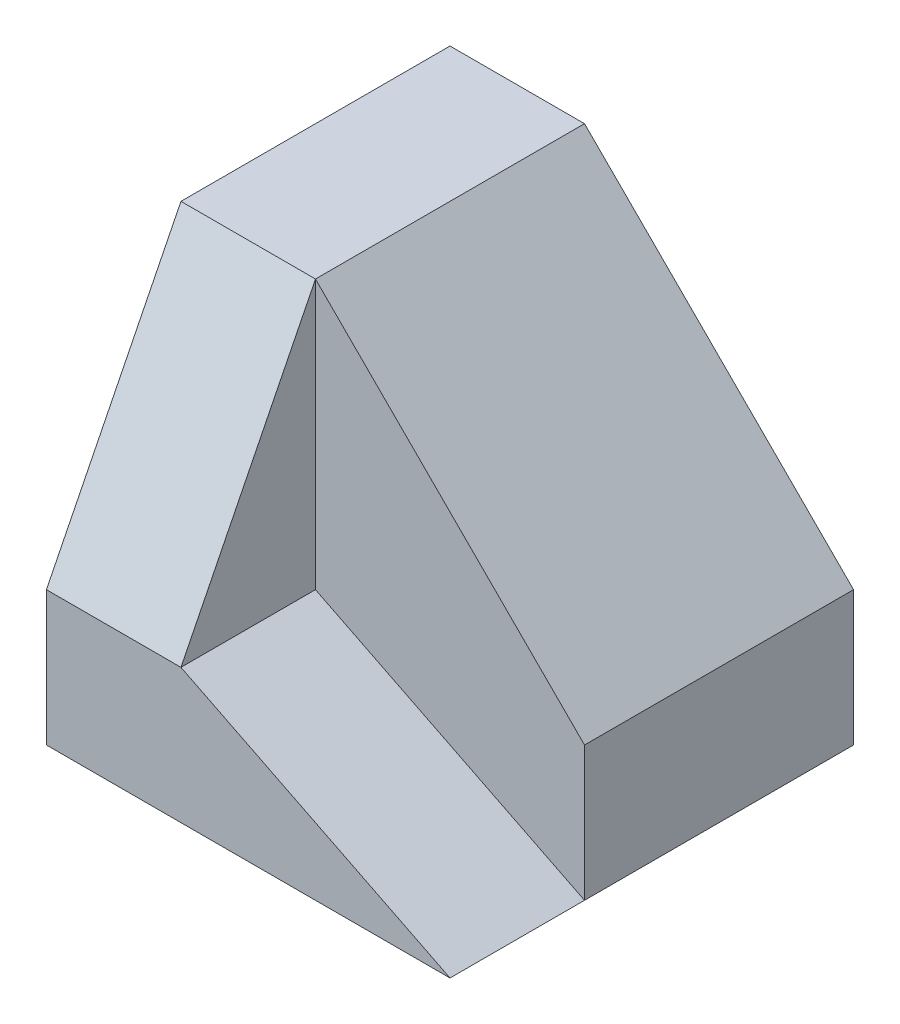
ISO-10303-21;
HEADER;
FILE_DESCRIPTION(('STEP AP214'),'2;1');
FILE_NAME('part.step','',(''),(''),'','','');
FILE_SCHEMA(('AUTOMOTIVE_DESIGN { 1 0 10303 214 1 1 1 1 }'));
ENDSEC;
DATA;
#1=APPLICATION_CONTEXT('core data for automotive mechanical design processes');
#2=APPLICATION_PROTOCOL_DEFINITION('international standard','automotive_design',2000,#1);
#3=PRODUCT_CONTEXT('',#1,'mechanical');
#4=PRODUCT('Part','Part','',(#3));
#5=PRODUCT_RELATED_PRODUCT_CATEGORY('part','',(#4));
#6=PRODUCT_DEFINITION_FORMATION('','',#4);
#7=PRODUCT_DEFINITION_CONTEXT('part definition',#1,'design');
#8=PRODUCT_DEFINITION('design','',#6,#7);
#9=PRODUCT_DEFINITION_SHAPE('','',#8);
#10=(LENGTH_UNIT() NAMED_UNIT(*) SI_UNIT(.MILLI.,.METRE.));
#11=(NAMED_UNIT(*) PLANE_ANGLE_UNIT() SI_UNIT($,.RADIAN.));
#12=(NAMED_UNIT(*) SI_UNIT($,.STERADIAN.) SOLID_ANGLE_UNIT());
#13=UNCERTAINTY_MEASURE_WITH_UNIT(LENGTH_MEASURE(1.E-05),#10,'distance_accuracy_value','');
#14=(GEOMETRIC_REPRESENTATION_CONTEXT(3) GLOBAL_UNCERTAINTY_ASSIGNED_CONTEXT((#13)) GLOBAL_UNIT_ASSIGNED_CONTEXT((#10,
#11,#12)) REPRESENTATION_CONTEXT('',''));
#15=CARTESIAN_POINT('',(0.,0.,0.));
#16=DIRECTION('',(0.,0.,1.));
#17=DIRECTION('',(1.,0.,0.));
#18=AXIS2_PLACEMENT_3D('',#15,#16,#17);
#19=CARTESIAN_POINT('',(0.,60.,0.));
#20=DIRECTION('',(1.,0.,0.));
#21=DIRECTION('',(0.,0.,-1.));
#22=AXIS2_PLACEMENT_3D('',#19,#20,#21);
#23=PLANE('',#22);
#24=DIRECTION('',(0.,-1.,0.));
#25=VECTOR('',#24,1.);
#26=CARTESIAN_POINT('',(0.,60.,60.));
#27=LINE('',#26,#25);
#28=CARTESIAN_POINT('',(0.,20.,60.));
#29=VERTEX_POINT('',#28);
#30=CARTESIAN_POINT('',(0.,0.,60.));
#31=VERTEX_POINT('',#30);
#32=EDGE_CURVE('E11',#29,#31,#27,.T.);
#33=ORIENTED_EDGE('',*,*,#32,.F.);
#34=DIRECTION('',(0.,0.894427190999916,-0.447213595499958));
#35=VECTOR('',#34,1.);
#36=CARTESIAN_POINT('',(0.,60.,40.));
#37=LINE('',#36,#35);
#38=CARTESIAN_POINT('',(0.,60.,40.));
#39=VERTEX_POINT('',#38);
#40=EDGE_CURVE('E194',#29,#39,#37,.T.);
#41=ORIENTED_EDGE('',*,*,#40,.T.);
#42=DIRECTION('',(0.,0.,1.));
#43=VECTOR('',#42,1.);
#44=CARTESIAN_POINT('',(0.,60.,0.));
#45=LINE('',#44,#43);
#46=CARTESIAN_POINT('',(0.,60.,0.));
#47=VERTEX_POINT('',#46);
#48=EDGE_CURVE('E99',#47,#39,#45,.T.);
#49=ORIENTED_EDGE('',*,*,#48,.F.);
#50=DIRECTION('',(0.,-1.,0.));
#51=VECTOR('',#50,1.);
#52=CARTESIAN_POINT('',(0.,60.,0.));
#53=LINE('',#52,#51);
#54=CARTESIAN_POINT('',(0.,0.,0.));
#55=VERTEX_POINT('',#54);
#56=EDGE_CURVE('E92',#47,#55,#53,.T.);
#57=ORIENTED_EDGE('',*,*,#56,.T.);
#58=DIRECTION('',(0.,0.,1.));
#59=VECTOR('',#58,1.);
#60=CARTESIAN_POINT('',(0.,0.,0.));
#61=LINE('',#60,#59);
#62=EDGE_CURVE('E97',#55,#31,#61,.T.);
#63=ORIENTED_EDGE('',*,*,#62,.T.);
#64=EDGE_LOOP('',(#33,#41,#49,#57,#63));
#65=FACE_BOUND('',#64,.T.);
#66=ADVANCED_FACE('F39',(#65),#23,.F.);
#67=CARTESIAN_POINT('',(0.,60.,60.));
#68=DIRECTION('',(0.,0.,-1.));
#69=DIRECTION('',(-1.,0.,0.));
#70=AXIS2_PLACEMENT_3D('',#67,#68,#69);
#71=PLANE('',#70);
#72=DIRECTION('',(0.894427190999916,-0.447213595499958,0.));
#73=VECTOR('',#72,1.);
#74=CARTESIAN_POINT('',(20.,20.,60.));
#75=LINE('',#74,#73);
#76=CARTESIAN_POINT('',(20.,20.,60.));
#77=VERTEX_POINT('',#76);
#78=CARTESIAN_POINT('',(60.,0.,60.));
#79=VERTEX_POINT('',#78);
#80=EDGE_CURVE('E125',#77,#79,#75,.T.);
#81=ORIENTED_EDGE('',*,*,#80,.F.);
#82=DIRECTION('',(1.,0.,0.));
#83=VECTOR('',#82,1.);
#84=CARTESIAN_POINT('',(0.,20.,60.));
#85=LINE('',#84,#83);
#86=EDGE_CURVE('E152',#29,#77,#85,.T.);
#87=ORIENTED_EDGE('',*,*,#86,.F.);
#88=ORIENTED_EDGE('',*,*,#32,.T.);
#89=DIRECTION('',(1.,0.,0.));
#90=VECTOR('',#89,1.);
#91=CARTESIAN_POINT('',(0.,0.,60.));
#92=LINE('',#91,#90);
#93=EDGE_CURVE('E82',#31,#79,#92,.T.);
#94=ORIENTED_EDGE('',*,*,#93,.T.);
#95=EDGE_LOOP('',(#81,#87,#88,#94));
#96=FACE_BOUND('',#95,.T.);
#97=ADVANCED_FACE('F121',(#96),#71,.F.);
#98=CARTESIAN_POINT('',(60.,60.,0.));
#99=DIRECTION('',(-1.,0.,0.));
#100=DIRECTION('',(0.,0.,1.));
#101=AXIS2_PLACEMENT_3D('',#98,#99,#100);
#102=PLANE('',#101);
#103=DIRECTION('',(0.,0.,1.));
#104=VECTOR('',#103,1.);
#105=CARTESIAN_POINT('',(60.,20.,0.));
#106=LINE('',#105,#104);
#107=CARTESIAN_POINT('',(60.,20.,0.));
#108=VERTEX_POINT('',#107);
#109=CARTESIAN_POINT('',(60.,20.,40.));
#110=VERTEX_POINT('',#109);
#111=EDGE_CURVE('E158',#108,#110,#106,.T.);
#112=ORIENTED_EDGE('',*,*,#111,.T.);
#113=DIRECTION('',(0.,1.,0.));
#114=VECTOR('',#113,1.);
#115=CARTESIAN_POINT('',(60.,0.,40.));
#116=LINE('',#115,#114);
#117=CARTESIAN_POINT('',(60.,0.,40.));
#118=VERTEX_POINT('',#117);
#119=EDGE_CURVE('E76',#118,#110,#116,.T.);
#120=ORIENTED_EDGE('',*,*,#119,.F.);
#121=DIRECTION('',(0.,0.,-1.));
#122=VECTOR('',#121,1.);
#123=CARTESIAN_POINT('',(60.,0.,0.));
#124=LINE('',#123,#122);
#125=CARTESIAN_POINT('',(60.,0.,0.));
#126=VERTEX_POINT('',#125);
#127=EDGE_CURVE('E69',#118,#126,#124,.T.);
#128=ORIENTED_EDGE('',*,*,#127,.T.);
#129=DIRECTION('',(0.,-1.,0.));
#130=VECTOR('',#129,1.);
#131=CARTESIAN_POINT('',(60.,60.,0.));
#132=LINE('',#131,#130);
#133=EDGE_CURVE('E48',#108,#126,#132,.T.);
#134=ORIENTED_EDGE('',*,*,#133,.F.);
#135=EDGE_LOOP('',(#112,#120,#128,#134));
#136=FACE_BOUND('',#135,.T.);
#137=ADVANCED_FACE('F72',(#136),#102,.F.);
#138=CARTESIAN_POINT('',(0.,60.,0.));
#139=DIRECTION('',(0.,0.,1.));
#140=DIRECTION('',(1.,0.,0.));
#141=AXIS2_PLACEMENT_3D('',#138,#139,#140);
#142=PLANE('',#141);
#143=DIRECTION('',(-1.,0.,0.));
#144=VECTOR('',#143,1.);
#145=CARTESIAN_POINT('',(0.,60.,0.));
#146=LINE('',#145,#144);
#147=CARTESIAN_POINT('',(20.,60.,0.));
#148=VERTEX_POINT('',#147);
#149=EDGE_CURVE('E55',#148,#47,#146,.T.);
#150=ORIENTED_EDGE('',*,*,#149,.F.);
#151=DIRECTION('',(0.707106781186548,-0.707106781186547,0.));
#152=VECTOR('',#151,1.);
#153=CARTESIAN_POINT('',(20.,60.,0.));
#154=LINE('',#153,#152);
#155=EDGE_CURVE('E90',#148,#108,#154,.T.);
#156=ORIENTED_EDGE('',*,*,#155,.T.);
#157=ORIENTED_EDGE('',*,*,#133,.T.);
#158=DIRECTION('',(-1.,0.,0.));
#159=VECTOR('',#158,1.);
#160=CARTESIAN_POINT('',(0.,0.,0.));
#161=LINE('',#160,#159);
#162=EDGE_CURVE('E87',#126,#55,#161,.T.);
#163=ORIENTED_EDGE('',*,*,#162,.T.);
#164=ORIENTED_EDGE('',*,*,#56,.F.);
#165=EDGE_LOOP('',(#150,#156,#157,#163,#164));
#166=FACE_BOUND('',#165,.T.);
#167=ADVANCED_FACE('F86',(#166),#142,.F.);
#168=CARTESIAN_POINT('',(0.,60.,0.));
#169=DIRECTION('',(0.,1.,0.));
#170=DIRECTION('',(0.,0.,1.));
#171=AXIS2_PLACEMENT_3D('',#168,#169,#170);
#172=PLANE('',#171);
#173=DIRECTION('',(1.,0.,0.));
#174=VECTOR('',#173,1.);
#175=CARTESIAN_POINT('',(0.,60.,40.));
#176=LINE('',#175,#174);
#177=CARTESIAN_POINT('',(20.,60.,40.));
#178=VERTEX_POINT('',#177);
#179=EDGE_CURVE('E149',#39,#178,#176,.T.);
#180=ORIENTED_EDGE('',*,*,#179,.T.);
#181=DIRECTION('',(0.,0.,1.));
#182=VECTOR('',#181,1.);
#183=CARTESIAN_POINT('',(20.,60.,0.));
#184=LINE('',#183,#182);
#185=EDGE_CURVE('E157',#148,#178,#184,.T.);
#186=ORIENTED_EDGE('',*,*,#185,.F.);
#187=ORIENTED_EDGE('',*,*,#149,.T.);
#188=ORIENTED_EDGE('',*,*,#48,.T.);
#189=EDGE_LOOP('',(#180,#186,#187,#188));
#190=FACE_BOUND('',#189,.T.);
#191=ADVANCED_FACE('F192',(#190),#172,.T.);
#192=CARTESIAN_POINT('',(0.,0.,0.));
#193=DIRECTION('',(0.,1.,0.));
#194=DIRECTION('',(0.,0.,1.));
#195=AXIS2_PLACEMENT_3D('',#192,#193,#194);
#196=PLANE('',#195);
#197=ORIENTED_EDGE('',*,*,#62,.F.);
#198=ORIENTED_EDGE('',*,*,#162,.F.);
#199=ORIENTED_EDGE('',*,*,#127,.F.);
#200=EDGE_CURVE('E81',#79,#118,#124,.T.);
#201=ORIENTED_EDGE('',*,*,#200,.F.);
#202=ORIENTED_EDGE('',*,*,#93,.F.);
#203=EDGE_LOOP('',(#197,#198,#199,#201,#202));
#204=FACE_BOUND('',#203,.T.);
#205=ADVANCED_FACE('F94',(#204),#196,.F.);
#206=CARTESIAN_POINT('',(20.,20.,60.));
#207=DIRECTION('',(-1.,0.,0.));
#208=DIRECTION('',(0.,0.,1.));
#209=AXIS2_PLACEMENT_3D('',#206,#207,#208);
#210=PLANE('',#209);
#211=DIRECTION('',(0.,1.,0.));
#212=VECTOR('',#211,1.);
#213=CARTESIAN_POINT('',(20.,20.,40.));
#214=LINE('',#213,#212);
#215=CARTESIAN_POINT('',(20.,20.,40.));
#216=VERTEX_POINT('',#215);
#217=EDGE_CURVE('E115',#216,#178,#214,.T.);
#218=ORIENTED_EDGE('',*,*,#217,.T.);
#219=DIRECTION('',(0.,0.894427190999916,-0.447213595499958));
#220=VECTOR('',#219,1.);
#221=CARTESIAN_POINT('',(20.,60.,40.));
#222=LINE('',#221,#220);
#223=EDGE_CURVE('E175',#77,#178,#222,.T.);
#224=ORIENTED_EDGE('',*,*,#223,.F.);
#225=DIRECTION('',(0.,0.,1.));
#226=VECTOR('',#225,1.);
#227=CARTESIAN_POINT('',(20.,20.,60.));
#228=LINE('',#227,#226);
#229=EDGE_CURVE('E167',#216,#77,#228,.T.);
#230=ORIENTED_EDGE('',*,*,#229,.F.);
#231=EDGE_LOOP('',(#218,#224,#230));
#232=FACE_BOUND('',#231,.T.);
#233=ADVANCED_FACE('F173',(#232),#210,.F.);
#234=CARTESIAN_POINT('',(60.,20.,40.));
#235=DIRECTION('',(0.,0.,-1.));
#236=DIRECTION('',(-1.,0.,0.));
#237=AXIS2_PLACEMENT_3D('',#234,#235,#236);
#238=PLANE('',#237);
#239=ORIENTED_EDGE('',*,*,#217,.F.);
#240=DIRECTION('',(0.894427190999916,-0.447213595499958,0.));
#241=VECTOR('',#240,1.);
#242=CARTESIAN_POINT('',(20.,20.,40.));
#243=LINE('',#242,#241);
#244=EDGE_CURVE('E134',#216,#118,#243,.T.);
#245=ORIENTED_EDGE('',*,*,#244,.T.);
#246=ORIENTED_EDGE('',*,*,#119,.T.);
#247=DIRECTION('',(-0.707106781186548,0.707106781186547,0.));
#248=VECTOR('',#247,1.);
#249=CARTESIAN_POINT('',(60.,20.,40.));
#250=LINE('',#249,#248);
#251=EDGE_CURVE('E161',#110,#178,#250,.T.);
#252=ORIENTED_EDGE('',*,*,#251,.T.);
#253=EDGE_LOOP('',(#239,#245,#246,#252));
#254=FACE_BOUND('',#253,.T.);
#255=ADVANCED_FACE('F139',(#254),#238,.F.);
#256=CARTESIAN_POINT('',(20.,60.,0.));
#257=DIRECTION('',(-0.707106781186547,-0.707106781186548,0.));
#258=DIRECTION('',(0.707106781186548,-0.707106781186547,0.));
#259=AXIS2_PLACEMENT_3D('',#256,#257,#258);
#260=PLANE('',#259);
#261=ORIENTED_EDGE('',*,*,#111,.F.);
#262=ORIENTED_EDGE('',*,*,#155,.F.);
#263=ORIENTED_EDGE('',*,*,#185,.T.);
#264=ORIENTED_EDGE('',*,*,#251,.F.);
#265=EDGE_LOOP('',(#261,#262,#263,#264));
#266=FACE_BOUND('',#265,.T.);
#267=ADVANCED_FACE('F191',(#266),#260,.F.);
#268=CARTESIAN_POINT('',(20.,20.,40.));
#269=DIRECTION('',(-0.447213595499958,-0.894427190999916,0.));
#270=DIRECTION('',(0.894427190999916,-0.447213595499958,0.));
#271=AXIS2_PLACEMENT_3D('',#268,#269,#270);
#272=PLANE('',#271);
#273=ORIENTED_EDGE('',*,*,#80,.T.);
#274=ORIENTED_EDGE('',*,*,#200,.T.);
#275=ORIENTED_EDGE('',*,*,#244,.F.);
#276=ORIENTED_EDGE('',*,*,#229,.T.);
#277=EDGE_LOOP('',(#273,#274,#275,#276));
#278=FACE_BOUND('',#277,.T.);
#279=ADVANCED_FACE('F132',(#278),#272,.F.);
#280=CARTESIAN_POINT('',(0.,60.,40.));
#281=DIRECTION('',(0.,-0.447213595499958,-0.894427190999916));
#282=DIRECTION('',(0.,0.894427190999916,-0.447213595499958));
#283=AXIS2_PLACEMENT_3D('',#280,#281,#282);
#284=PLANE('',#283);
#285=ORIENTED_EDGE('',*,*,#223,.T.);
#286=ORIENTED_EDGE('',*,*,#179,.F.);
#287=ORIENTED_EDGE('',*,*,#40,.F.);
#288=ORIENTED_EDGE('',*,*,#86,.T.);
#289=EDGE_LOOP('',(#285,#286,#287,#288));
#290=FACE_BOUND('',#289,.T.);
#291=ADVANCED_FACE('F195',(#290),#284,.F.);
#292=CLOSED_SHELL('',(#66,#97,#137,#167,#191,#205,#233,#255,#267,#279,#291));
#293=MANIFOLD_SOLID_BREP('B2',#292);
#294=ADVANCED_BREP_SHAPE_REPRESENTATION('',(#18,#293),#14);
#295=SHAPE_DEFINITION_REPRESENTATION(#9,#294);
ENDSEC;
END-ISO-10303-21;
